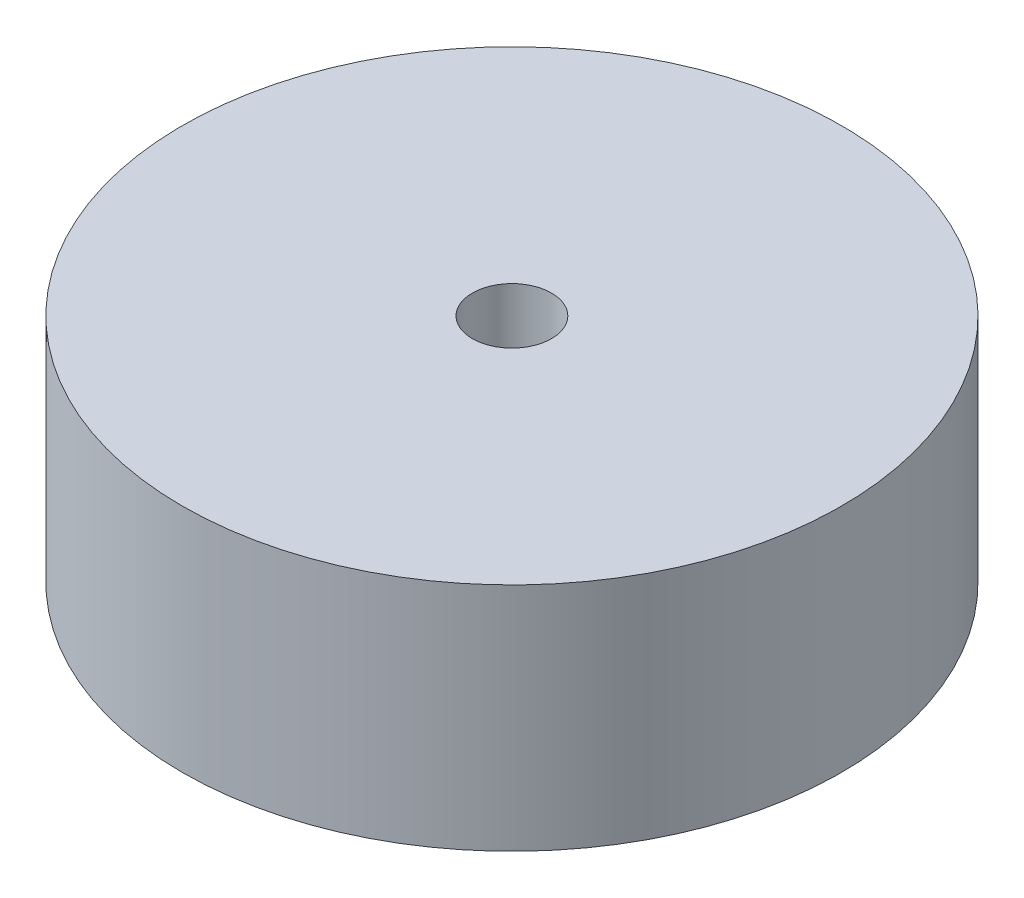
ISO-10303-21;
HEADER;
FILE_DESCRIPTION(('STEP AP214'),'2;1');
FILE_NAME('part.step','',(''),(''),'','','');
FILE_SCHEMA(('AUTOMOTIVE_DESIGN { 1 0 10303 214 1 1 1 1 }'));
ENDSEC;
DATA;
#1=APPLICATION_CONTEXT('core data for automotive mechanical design processes');
#2=APPLICATION_PROTOCOL_DEFINITION('international standard','automotive_design',2000,#1);
#3=PRODUCT_CONTEXT('',#1,'mechanical');
#4=PRODUCT('Part','Part','',(#3));
#5=PRODUCT_RELATED_PRODUCT_CATEGORY('part','',(#4));
#6=PRODUCT_DEFINITION_FORMATION('','',#4);
#7=PRODUCT_DEFINITION_CONTEXT('part definition',#1,'design');
#8=PRODUCT_DEFINITION('design','',#6,#7);
#9=PRODUCT_DEFINITION_SHAPE('','',#8);
#10=(LENGTH_UNIT() NAMED_UNIT(*) SI_UNIT(.MILLI.,.METRE.));
#11=(NAMED_UNIT(*) PLANE_ANGLE_UNIT() SI_UNIT($,.RADIAN.));
#12=(NAMED_UNIT(*) SI_UNIT($,.STERADIAN.) SOLID_ANGLE_UNIT());
#13=UNCERTAINTY_MEASURE_WITH_UNIT(LENGTH_MEASURE(1.E-05),#10,'distance_accuracy_value','');
#14=(GEOMETRIC_REPRESENTATION_CONTEXT(3) GLOBAL_UNCERTAINTY_ASSIGNED_CONTEXT((#13)) GLOBAL_UNIT_ASSIGNED_CONTEXT((#10,
#11,#12)) REPRESENTATION_CONTEXT('',''));
#15=CARTESIAN_POINT('',(0.,0.,0.));
#16=DIRECTION('',(0.,0.,1.));
#17=DIRECTION('',(1.,0.,0.));
#18=AXIS2_PLACEMENT_3D('',#15,#16,#17);
#19=CARTESIAN_POINT('',(0.,35.,0.));
#20=DIRECTION('',(0.,1.,0.));
#21=DIRECTION('',(0.,0.,1.));
#22=AXIS2_PLACEMENT_3D('',#19,#20,#21);
#23=PLANE('',#22);
#24=CARTESIAN_POINT('',(0.,35.,0.));
#25=DIRECTION('',(0.,1.,0.));
#26=DIRECTION('',(0.,0.,1.));
#27=AXIS2_PLACEMENT_3D('',#24,#25,#26);
#28=CIRCLE('',#27,50.);
#29=CARTESIAN_POINT('',(0.,35.,50.));
#30=VERTEX_POINT('',#29);
#31=EDGE_CURVE('E10',#30,#30,#28,.T.);
#32=ORIENTED_EDGE('',*,*,#31,.T.);
#33=EDGE_LOOP('',(#32));
#34=FACE_BOUND('',#33,.T.);
#35=CARTESIAN_POINT('',(0.,35.,0.));
#36=DIRECTION('',(0.,1.,0.));
#37=DIRECTION('',(0.,0.,1.));
#38=AXIS2_PLACEMENT_3D('',#35,#36,#37);
#39=CIRCLE('',#38,6.);
#40=CARTESIAN_POINT('',(0.,35.,6.));
#41=VERTEX_POINT('',#40);
#42=EDGE_CURVE('E42',#41,#41,#39,.T.);
#43=ORIENTED_EDGE('',*,*,#42,.F.);
#44=EDGE_LOOP('',(#43));
#45=FACE_BOUND('',#44,.T.);
#46=ADVANCED_FACE('F31',(#34,#45),#23,.T.);
#47=CARTESIAN_POINT('',(0.,0.,0.));
#48=DIRECTION('',(0.,1.,0.));
#49=DIRECTION('',(0.,0.,1.));
#50=AXIS2_PLACEMENT_3D('',#47,#48,#49);
#51=PLANE('',#50);
#52=CARTESIAN_POINT('',(0.,0.,0.));
#53=DIRECTION('',(0.,1.,0.));
#54=DIRECTION('',(0.,0.,1.));
#55=AXIS2_PLACEMENT_3D('',#52,#53,#54);
#56=CIRCLE('',#55,50.);
#57=CARTESIAN_POINT('',(0.,0.,50.));
#58=VERTEX_POINT('',#57);
#59=EDGE_CURVE('E35',#58,#58,#56,.T.);
#60=ORIENTED_EDGE('',*,*,#59,.F.);
#61=EDGE_LOOP('',(#60));
#62=FACE_BOUND('',#61,.T.);
#63=CARTESIAN_POINT('',(0.,0.,0.));
#64=DIRECTION('',(0.,1.,0.));
#65=DIRECTION('',(0.,0.,1.));
#66=AXIS2_PLACEMENT_3D('',#63,#64,#65);
#67=CIRCLE('',#66,6.);
#68=CARTESIAN_POINT('',(0.,0.,6.));
#69=VERTEX_POINT('',#68);
#70=EDGE_CURVE('E44',#69,#69,#67,.T.);
#71=ORIENTED_EDGE('',*,*,#70,.T.);
#72=EDGE_LOOP('',(#71));
#73=FACE_BOUND('',#72,.T.);
#74=ADVANCED_FACE('F54',(#62,#73),#51,.F.);
#75=CARTESIAN_POINT('',(0.,35.,0.));
#76=DIRECTION('',(0.,-1.,0.));
#77=DIRECTION('',(0.,0.,-1.));
#78=AXIS2_PLACEMENT_3D('',#75,#76,#77);
#79=CYLINDRICAL_SURFACE('',#78,50.);
#80=ORIENTED_EDGE('',*,*,#31,.F.);
#81=EDGE_LOOP('',(#80));
#82=FACE_BOUND('',#81,.T.);
#83=ORIENTED_EDGE('',*,*,#59,.T.);
#84=EDGE_LOOP('',(#83));
#85=FACE_BOUND('',#84,.T.);
#86=ADVANCED_FACE('F33',(#82,#85),#79,.T.);
#87=CARTESIAN_POINT('',(0.,35.,0.));
#88=DIRECTION('',(0.,-1.,0.));
#89=DIRECTION('',(0.,0.,-1.));
#90=AXIS2_PLACEMENT_3D('',#87,#88,#89);
#91=CYLINDRICAL_SURFACE('',#90,6.);
#92=ORIENTED_EDGE('',*,*,#42,.T.);
#93=EDGE_LOOP('',(#92));
#94=FACE_BOUND('',#93,.T.);
#95=ORIENTED_EDGE('',*,*,#70,.F.);
#96=EDGE_LOOP('',(#95));
#97=FACE_BOUND('',#96,.T.);
#98=ADVANCED_FACE('F50',(#94,#97),#91,.F.);
#99=CLOSED_SHELL('',(#46,#74,#86,#98));
#100=MANIFOLD_SOLID_BREP('B2',#99);
#101=ADVANCED_BREP_SHAPE_REPRESENTATION('',(#18,#100),#14);
#102=SHAPE_DEFINITION_REPRESENTATION(#9,#101);
ENDSEC;
END-ISO-10303-21;
